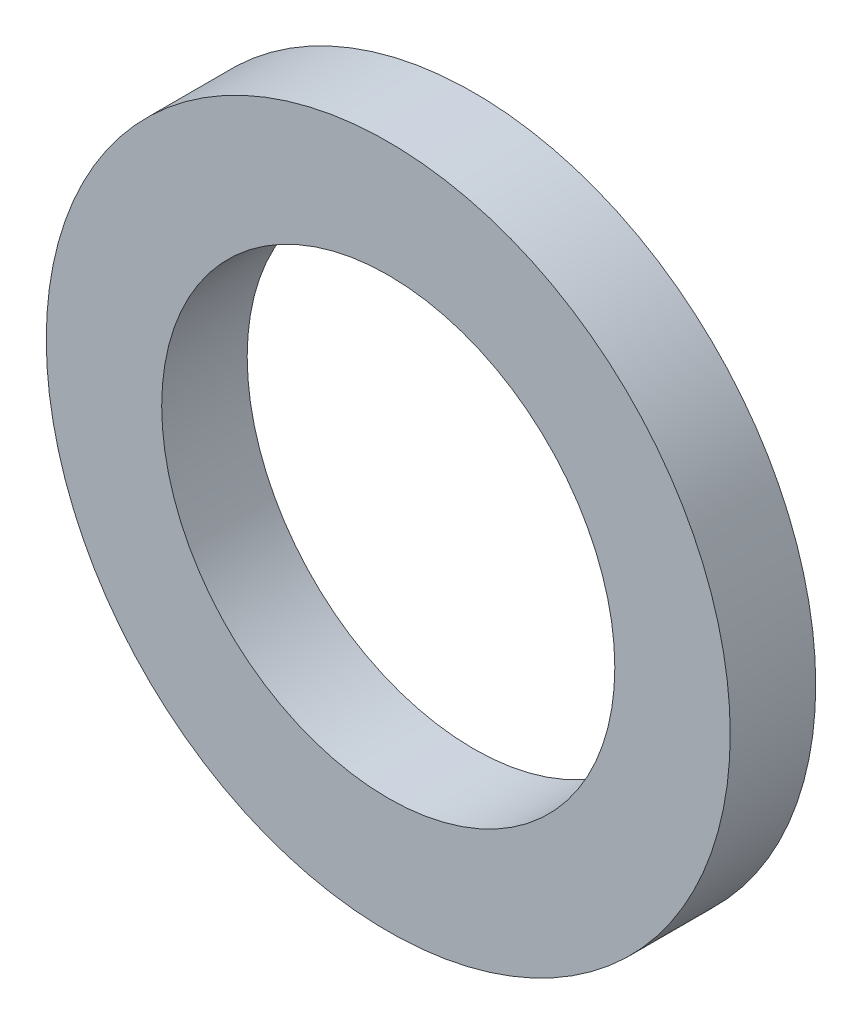
ISO-10303-21;
HEADER;
FILE_DESCRIPTION(('STEP AP214'),'2;1');
FILE_NAME('part.step','',(''),(''),'','','');
FILE_SCHEMA(('AUTOMOTIVE_DESIGN { 1 0 10303 214 1 1 1 1 }'));
ENDSEC;
DATA;
#1=APPLICATION_CONTEXT('core data for automotive mechanical design processes');
#2=APPLICATION_PROTOCOL_DEFINITION('international standard','automotive_design',2000,#1);
#3=PRODUCT_CONTEXT('',#1,'mechanical');
#4=PRODUCT('Part','Part','',(#3));
#5=PRODUCT_RELATED_PRODUCT_CATEGORY('part','',(#4));
#6=PRODUCT_DEFINITION_FORMATION('','',#4);
#7=PRODUCT_DEFINITION_CONTEXT('part definition',#1,'design');
#8=PRODUCT_DEFINITION('design','',#6,#7);
#9=PRODUCT_DEFINITION_SHAPE('','',#8);
#10=(LENGTH_UNIT() NAMED_UNIT(*) SI_UNIT(.MILLI.,.METRE.));
#11=(NAMED_UNIT(*) PLANE_ANGLE_UNIT() SI_UNIT($,.RADIAN.));
#12=(NAMED_UNIT(*) SI_UNIT($,.STERADIAN.) SOLID_ANGLE_UNIT());
#13=UNCERTAINTY_MEASURE_WITH_UNIT(LENGTH_MEASURE(1.E-05),#10,'distance_accuracy_value','');
#14=(GEOMETRIC_REPRESENTATION_CONTEXT(3) GLOBAL_UNCERTAINTY_ASSIGNED_CONTEXT((#13)) GLOBAL_UNIT_ASSIGNED_CONTEXT((#10,
#11,#12)) REPRESENTATION_CONTEXT('',''));
#15=CARTESIAN_POINT('',(0.,0.,0.));
#16=DIRECTION('',(0.,0.,1.));
#17=DIRECTION('',(1.,0.,0.));
#18=AXIS2_PLACEMENT_3D('',#15,#16,#17);
#19=CARTESIAN_POINT('',(-1.17891079077026,1.40815339267419,0.270986243618154));
#20=DIRECTION('',(0.,0.,1.));
#21=DIRECTION('',(1.,0.,0.));
#22=AXIS2_PLACEMENT_3D('',#19,#20,#21);
#23=PLANE('',#22);
#24=CARTESIAN_POINT('',(-1.17891079077026,1.40815339267419,0.270986243618154));
#25=DIRECTION('',(0.,0.,1.));
#26=DIRECTION('',(1.,0.,0.));
#27=AXIS2_PLACEMENT_3D('',#24,#25,#26);
#28=CIRCLE('',#27,4.);
#29=CARTESIAN_POINT('',(2.82108920922974,1.40815339267419,0.270986243618154));
#30=VERTEX_POINT('',#29);
#31=EDGE_CURVE('E9',#30,#30,#28,.T.);
#32=ORIENTED_EDGE('',*,*,#31,.T.);
#33=EDGE_LOOP('',(#32));
#34=FACE_BOUND('',#33,.T.);
#35=CARTESIAN_POINT('',(-1.17891079077026,1.40815339267419,0.270986243618154));
#36=DIRECTION('',(0.,0.,1.));
#37=DIRECTION('',(1.,0.,0.));
#38=AXIS2_PLACEMENT_3D('',#35,#36,#37);
#39=CIRCLE('',#38,2.65);
#40=CARTESIAN_POINT('',(1.47108920922974,1.40815339267419,0.270986243618154));
#41=VERTEX_POINT('',#40);
#42=EDGE_CURVE('E25',#41,#41,#39,.T.);
#43=ORIENTED_EDGE('',*,*,#42,.F.);
#44=EDGE_LOOP('',(#43));
#45=FACE_BOUND('',#44,.T.);
#46=ADVANCED_FACE('F14',(#34,#45),#23,.T.);
#47=CARTESIAN_POINT('',(-1.17891079077026,1.40815339267419,-0.729013756381846));
#48=DIRECTION('',(0.,0.,1.));
#49=DIRECTION('',(1.,0.,0.));
#50=AXIS2_PLACEMENT_3D('',#47,#48,#49);
#51=PLANE('',#50);
#52=CARTESIAN_POINT('',(-1.17891079077026,1.40815339267419,-0.729013756381846));
#53=DIRECTION('',(0.,0.,1.));
#54=DIRECTION('',(1.,0.,0.));
#55=AXIS2_PLACEMENT_3D('',#52,#53,#54);
#56=CIRCLE('',#55,4.);
#57=CARTESIAN_POINT('',(2.82108920922974,1.40815339267419,-0.729013756381846));
#58=VERTEX_POINT('',#57);
#59=EDGE_CURVE('E18',#58,#58,#56,.T.);
#60=ORIENTED_EDGE('',*,*,#59,.F.);
#61=EDGE_LOOP('',(#60));
#62=FACE_BOUND('',#61,.T.);
#63=CARTESIAN_POINT('',(-1.17891079077026,1.40815339267419,-0.729013756381846));
#64=DIRECTION('',(0.,0.,1.));
#65=DIRECTION('',(1.,0.,0.));
#66=AXIS2_PLACEMENT_3D('',#63,#64,#65);
#67=CIRCLE('',#66,2.65);
#68=CARTESIAN_POINT('',(1.47108920922974,1.40815339267419,-0.729013756381846));
#69=VERTEX_POINT('',#68);
#70=EDGE_CURVE('E27',#69,#69,#67,.T.);
#71=ORIENTED_EDGE('',*,*,#70,.T.);
#72=EDGE_LOOP('',(#71));
#73=FACE_BOUND('',#72,.T.);
#74=ADVANCED_FACE('F37',(#62,#73),#51,.F.);
#75=CARTESIAN_POINT('',(-1.17891079077026,1.40815339267419,0.270986243618154));
#76=DIRECTION('',(0.,0.,-1.));
#77=DIRECTION('',(-1.,0.,0.));
#78=AXIS2_PLACEMENT_3D('',#75,#76,#77);
#79=CYLINDRICAL_SURFACE('',#78,4.);
#80=ORIENTED_EDGE('',*,*,#31,.F.);
#81=EDGE_LOOP('',(#80));
#82=FACE_BOUND('',#81,.T.);
#83=ORIENTED_EDGE('',*,*,#59,.T.);
#84=EDGE_LOOP('',(#83));
#85=FACE_BOUND('',#84,.T.);
#86=ADVANCED_FACE('F16',(#82,#85),#79,.T.);
#87=CARTESIAN_POINT('',(-1.17891079077026,1.40815339267419,0.270986243618154));
#88=DIRECTION('',(0.,0.,-1.));
#89=DIRECTION('',(-1.,0.,0.));
#90=AXIS2_PLACEMENT_3D('',#87,#88,#89);
#91=CYLINDRICAL_SURFACE('',#90,2.65);
#92=ORIENTED_EDGE('',*,*,#42,.T.);
#93=EDGE_LOOP('',(#92));
#94=FACE_BOUND('',#93,.T.);
#95=ORIENTED_EDGE('',*,*,#70,.F.);
#96=EDGE_LOOP('',(#95));
#97=FACE_BOUND('',#96,.T.);
#98=ADVANCED_FACE('F33',(#94,#97),#91,.F.);
#99=CLOSED_SHELL('',(#46,#74,#86,#98));
#100=MANIFOLD_SOLID_BREP('B1',#99);
#101=ADVANCED_BREP_SHAPE_REPRESENTATION('',(#18,#100),#14);
#102=SHAPE_DEFINITION_REPRESENTATION(#9,#101);
ENDSEC;
END-ISO-10303-21;
